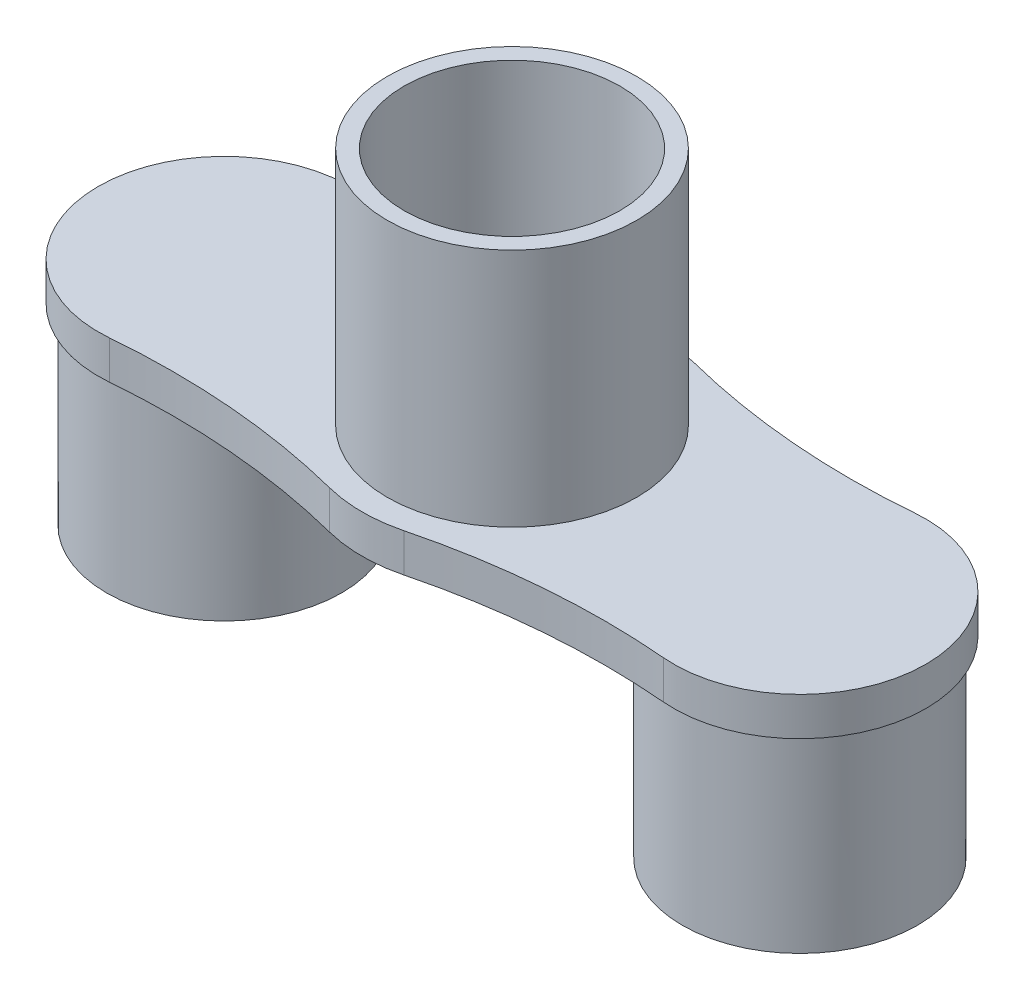
ISO-10303-21;
HEADER;
FILE_DESCRIPTION(('STEP AP214'),'2;1');
FILE_NAME('part.step','',(''),(''),'','','');
FILE_SCHEMA(('AUTOMOTIVE_DESIGN { 1 0 10303 214 1 1 1 1 }'));
ENDSEC;
DATA;
#1=APPLICATION_CONTEXT('core data for automotive mechanical design processes');
#2=APPLICATION_PROTOCOL_DEFINITION('international standard','automotive_design',2000,#1);
#3=PRODUCT_CONTEXT('',#1,'mechanical');
#4=PRODUCT('Part','Part','',(#3));
#5=PRODUCT_RELATED_PRODUCT_CATEGORY('part','',(#4));
#6=PRODUCT_DEFINITION_FORMATION('','',#4);
#7=PRODUCT_DEFINITION_CONTEXT('part definition',#1,'design');
#8=PRODUCT_DEFINITION('design','',#6,#7);
#9=PRODUCT_DEFINITION_SHAPE('','',#8);
#10=(LENGTH_UNIT() NAMED_UNIT(*) SI_UNIT(.MILLI.,.METRE.));
#11=(NAMED_UNIT(*) PLANE_ANGLE_UNIT() SI_UNIT($,.RADIAN.));
#12=(NAMED_UNIT(*) SI_UNIT($,.STERADIAN.) SOLID_ANGLE_UNIT());
#13=UNCERTAINTY_MEASURE_WITH_UNIT(LENGTH_MEASURE(1.E-05),#10,'distance_accuracy_value','');
#14=(GEOMETRIC_REPRESENTATION_CONTEXT(3) GLOBAL_UNCERTAINTY_ASSIGNED_CONTEXT((#13)) GLOBAL_UNIT_ASSIGNED_CONTEXT((#10,
#11,#12)) REPRESENTATION_CONTEXT('',''));
#15=CARTESIAN_POINT('',(0.,0.,0.));
#16=DIRECTION('',(0.,0.,1.));
#17=DIRECTION('',(1.,0.,0.));
#18=AXIS2_PLACEMENT_3D('',#15,#16,#17);
#19=CARTESIAN_POINT('',(-44.8958333333334,8.,-175.60161345872));
#20=DIRECTION('',(0.,-1.,0.));
#21=DIRECTION('',(0.,0.,-1.));
#22=AXIS2_PLACEMENT_3D('',#19,#20,#21);
#23=CYLINDRICAL_SURFACE('',#22,150.);
#24=CARTESIAN_POINT('',(-44.8958333333334,0.,-175.60161345872));
#25=DIRECTION('',(0.,-1.,0.));
#26=DIRECTION('',(0.,0.,1.));
#27=AXIS2_PLACEMENT_3D('',#24,#25,#26);
#28=CIRCLE('',#27,150.);
#29=CARTESIAN_POINT('',(-7.74066091954024,0.,-30.2761402515034));
#30=VERTEX_POINT('',#29);
#31=CARTESIAN_POINT('',(-57.7504432624114,0.,-26.1534317917242));
#32=VERTEX_POINT('',#31);
#33=EDGE_CURVE('E150',#30,#32,#28,.T.);
#34=ORIENTED_EDGE('',*,*,#33,.T.);
#35=DIRECTION('',(0.,-1.,0.));
#36=VECTOR('',#35,1.);
#37=CARTESIAN_POINT('',(-57.7504432624114,8.,-26.1534317917242));
#38=LINE('',#37,#36);
#39=CARTESIAN_POINT('',(-57.7504432624114,8.,-26.1534317917242));
#40=VERTEX_POINT('',#39);
#41=EDGE_CURVE('E178',#40,#32,#38,.T.);
#42=ORIENTED_EDGE('',*,*,#41,.F.);
#43=CARTESIAN_POINT('',(-44.8958333333334,8.,-175.60161345872));
#44=DIRECTION('',(0.,-1.,0.));
#45=DIRECTION('',(0.,0.,1.));
#46=AXIS2_PLACEMENT_3D('',#43,#44,#45);
#47=CIRCLE('',#46,150.);
#48=CARTESIAN_POINT('',(-7.74066091954024,8.,-30.2761402515034));
#49=VERTEX_POINT('',#48);
#50=EDGE_CURVE('E165',#49,#40,#47,.T.);
#51=ORIENTED_EDGE('',*,*,#50,.F.);
#52=DIRECTION('',(0.,-1.,0.));
#53=VECTOR('',#52,1.);
#54=CARTESIAN_POINT('',(-7.74066091954024,8.,-30.2761402515034));
#55=LINE('',#54,#53);
#56=EDGE_CURVE('E146',#49,#30,#55,.T.);
#57=ORIENTED_EDGE('',*,*,#56,.T.);
#58=EDGE_LOOP('',(#34,#42,#51,#57));
#59=FACE_BOUND('',#58,.T.);
#60=ADVANCED_FACE('F53',(#59),#23,.F.);
#61=CARTESIAN_POINT('',(-60.,8.,0.));
#62=DIRECTION('',(0.,-1.,0.));
#63=DIRECTION('',(0.,0.,-1.));
#64=AXIS2_PLACEMENT_3D('',#61,#62,#63);
#65=CYLINDRICAL_SURFACE('',#64,26.25);
#66=CARTESIAN_POINT('',(-60.,0.,0.));
#67=DIRECTION('',(0.,1.,0.));
#68=DIRECTION('',(0.,0.,1.));
#69=AXIS2_PLACEMENT_3D('',#66,#67,#68);
#70=CIRCLE('',#69,26.25);
#71=CARTESIAN_POINT('',(-57.7504432624114,0.,26.1534317917242));
#72=VERTEX_POINT('',#71);
#73=EDGE_CURVE('E153',#32,#72,#70,.T.);
#74=ORIENTED_EDGE('',*,*,#73,.T.);
#75=DIRECTION('',(0.,-1.,0.));
#76=VECTOR('',#75,1.);
#77=CARTESIAN_POINT('',(-57.7504432624114,8.,26.1534317917242));
#78=LINE('',#77,#76);
#79=CARTESIAN_POINT('',(-57.7504432624114,8.,26.1534317917242));
#80=VERTEX_POINT('',#79);
#81=EDGE_CURVE('E175',#80,#72,#78,.T.);
#82=ORIENTED_EDGE('',*,*,#81,.F.);
#83=CARTESIAN_POINT('',(-60.,8.,0.));
#84=DIRECTION('',(0.,1.,0.));
#85=DIRECTION('',(0.,0.,1.));
#86=AXIS2_PLACEMENT_3D('',#83,#84,#85);
#87=CIRCLE('',#86,26.25);
#88=EDGE_CURVE('E113',#40,#80,#87,.T.);
#89=ORIENTED_EDGE('',*,*,#88,.F.);
#90=ORIENTED_EDGE('',*,*,#41,.T.);
#91=EDGE_LOOP('',(#74,#82,#89,#90));
#92=FACE_BOUND('',#91,.T.);
#93=ADVANCED_FACE('F212',(#92),#65,.T.);
#94=CARTESIAN_POINT('',(-44.8958333333333,8.,175.60161345872));
#95=DIRECTION('',(0.,-1.,0.));
#96=DIRECTION('',(0.,0.,-1.));
#97=AXIS2_PLACEMENT_3D('',#94,#95,#96);
#98=CYLINDRICAL_SURFACE('',#97,150.);
#99=CARTESIAN_POINT('',(-44.8958333333333,0.,175.60161345872));
#100=DIRECTION('',(0.,-1.,0.));
#101=DIRECTION('',(0.,0.,-1.));
#102=AXIS2_PLACEMENT_3D('',#99,#100,#101);
#103=CIRCLE('',#102,150.);
#104=CARTESIAN_POINT('',(-7.74066091954027,0.,30.2761402515034));
#105=VERTEX_POINT('',#104);
#106=EDGE_CURVE('E156',#72,#105,#103,.T.);
#107=ORIENTED_EDGE('',*,*,#106,.T.);
#108=DIRECTION('',(0.,-1.,0.));
#109=VECTOR('',#108,1.);
#110=CARTESIAN_POINT('',(-7.74066091954027,8.,30.2761402515034));
#111=LINE('',#110,#109);
#112=CARTESIAN_POINT('',(-7.74066091954027,8.,30.2761402515034));
#113=VERTEX_POINT('',#112);
#114=EDGE_CURVE('E172',#113,#105,#111,.T.);
#115=ORIENTED_EDGE('',*,*,#114,.F.);
#116=CARTESIAN_POINT('',(-44.8958333333333,8.,175.60161345872));
#117=DIRECTION('',(0.,-1.,0.));
#118=DIRECTION('',(0.,0.,-1.));
#119=AXIS2_PLACEMENT_3D('',#116,#117,#118);
#120=CIRCLE('',#119,150.);
#121=EDGE_CURVE('E403',#80,#113,#120,.T.);
#122=ORIENTED_EDGE('',*,*,#121,.F.);
#123=ORIENTED_EDGE('',*,*,#81,.T.);
#124=EDGE_LOOP('',(#107,#115,#122,#123));
#125=FACE_BOUND('',#124,.T.);
#126=ADVANCED_FACE('F216',(#125),#98,.F.);
#127=CARTESIAN_POINT('',(0.,8.,0.));
#128=DIRECTION('',(0.,-1.,0.));
#129=DIRECTION('',(0.,0.,-1.));
#130=AXIS2_PLACEMENT_3D('',#127,#128,#129);
#131=CYLINDRICAL_SURFACE('',#130,31.25);
#132=CARTESIAN_POINT('',(0.,0.,0.));
#133=DIRECTION('',(0.,1.,0.));
#134=DIRECTION('',(0.,0.,1.));
#135=AXIS2_PLACEMENT_3D('',#132,#133,#134);
#136=CIRCLE('',#135,31.25);
#137=CARTESIAN_POINT('',(7.74066091954025,0.,30.2761402515034));
#138=VERTEX_POINT('',#137);
#139=EDGE_CURVE('E158',#105,#138,#136,.T.);
#140=ORIENTED_EDGE('',*,*,#139,.T.);
#141=DIRECTION('',(0.,-1.,0.));
#142=VECTOR('',#141,1.);
#143=CARTESIAN_POINT('',(7.74066091954025,8.,30.2761402515034));
#144=LINE('',#143,#142);
#145=CARTESIAN_POINT('',(7.74066091954025,8.,30.2761402515034));
#146=VERTEX_POINT('',#145);
#147=EDGE_CURVE('E169',#146,#138,#144,.T.);
#148=ORIENTED_EDGE('',*,*,#147,.F.);
#149=CARTESIAN_POINT('',(0.,8.,0.));
#150=DIRECTION('',(0.,1.,0.));
#151=DIRECTION('',(0.,0.,1.));
#152=AXIS2_PLACEMENT_3D('',#149,#150,#151);
#153=CIRCLE('',#152,31.25);
#154=EDGE_CURVE('E405',#113,#146,#153,.T.);
#155=ORIENTED_EDGE('',*,*,#154,.F.);
#156=ORIENTED_EDGE('',*,*,#114,.T.);
#157=EDGE_LOOP('',(#140,#148,#155,#156));
#158=FACE_BOUND('',#157,.T.);
#159=ADVANCED_FACE('F220',(#158),#131,.T.);
#160=CARTESIAN_POINT('',(44.8958333333334,8.,175.60161345872));
#161=DIRECTION('',(0.,-1.,0.));
#162=DIRECTION('',(0.,0.,-1.));
#163=AXIS2_PLACEMENT_3D('',#160,#161,#162);
#164=CYLINDRICAL_SURFACE('',#163,150.);
#165=CARTESIAN_POINT('',(44.8958333333334,0.,175.60161345872));
#166=DIRECTION('',(0.,-1.,0.));
#167=DIRECTION('',(0.,0.,1.));
#168=AXIS2_PLACEMENT_3D('',#165,#166,#167);
#169=CIRCLE('',#168,150.);
#170=CARTESIAN_POINT('',(57.7504432624114,0.,26.1534317917242));
#171=VERTEX_POINT('',#170);
#172=EDGE_CURVE('E160',#138,#171,#169,.T.);
#173=ORIENTED_EDGE('',*,*,#172,.T.);
#174=DIRECTION('',(0.,-1.,0.));
#175=VECTOR('',#174,1.);
#176=CARTESIAN_POINT('',(57.7504432624114,8.,26.1534317917242));
#177=LINE('',#176,#175);
#178=CARTESIAN_POINT('',(57.7504432624114,8.,26.1534317917242));
#179=VERTEX_POINT('',#178);
#180=EDGE_CURVE('E141',#179,#171,#177,.T.);
#181=ORIENTED_EDGE('',*,*,#180,.F.);
#182=CARTESIAN_POINT('',(44.8958333333334,8.,175.60161345872));
#183=DIRECTION('',(0.,-1.,0.));
#184=DIRECTION('',(0.,0.,1.));
#185=AXIS2_PLACEMENT_3D('',#182,#183,#184);
#186=CIRCLE('',#185,150.);
#187=EDGE_CURVE('E132',#146,#179,#186,.T.);
#188=ORIENTED_EDGE('',*,*,#187,.F.);
#189=ORIENTED_EDGE('',*,*,#147,.T.);
#190=EDGE_LOOP('',(#173,#181,#188,#189));
#191=FACE_BOUND('',#190,.T.);
#192=ADVANCED_FACE('F226',(#191),#164,.F.);
#193=CARTESIAN_POINT('',(60.,8.,0.));
#194=DIRECTION('',(0.,-1.,0.));
#195=DIRECTION('',(0.,0.,-1.));
#196=AXIS2_PLACEMENT_3D('',#193,#194,#195);
#197=CYLINDRICAL_SURFACE('',#196,26.25);
#198=CARTESIAN_POINT('',(60.,0.,0.));
#199=DIRECTION('',(0.,1.,0.));
#200=DIRECTION('',(0.,0.,1.));
#201=AXIS2_PLACEMENT_3D('',#198,#199,#200);
#202=CIRCLE('',#201,26.25);
#203=CARTESIAN_POINT('',(57.7504432624113,0.,-26.1534317917242));
#204=VERTEX_POINT('',#203);
#205=EDGE_CURVE('E140',#171,#204,#202,.T.);
#206=ORIENTED_EDGE('',*,*,#205,.T.);
#207=DIRECTION('',(0.,-1.,0.));
#208=VECTOR('',#207,1.);
#209=CARTESIAN_POINT('',(57.7504432624113,8.,-26.1534317917242));
#210=LINE('',#209,#208);
#211=CARTESIAN_POINT('',(57.7504432624113,8.,-26.1534317917242));
#212=VERTEX_POINT('',#211);
#213=EDGE_CURVE('E137',#212,#204,#210,.T.);
#214=ORIENTED_EDGE('',*,*,#213,.F.);
#215=CARTESIAN_POINT('',(60.,8.,0.));
#216=DIRECTION('',(0.,1.,0.));
#217=DIRECTION('',(0.,0.,1.));
#218=AXIS2_PLACEMENT_3D('',#215,#216,#217);
#219=CIRCLE('',#218,26.25);
#220=EDGE_CURVE('E126',#179,#212,#219,.T.);
#221=ORIENTED_EDGE('',*,*,#220,.F.);
#222=ORIENTED_EDGE('',*,*,#180,.T.);
#223=EDGE_LOOP('',(#206,#214,#221,#222));
#224=FACE_BOUND('',#223,.T.);
#225=ADVANCED_FACE('F138',(#224),#197,.T.);
#226=CARTESIAN_POINT('',(44.8958333333334,8.,-175.60161345872));
#227=DIRECTION('',(0.,-1.,0.));
#228=DIRECTION('',(0.,0.,-1.));
#229=AXIS2_PLACEMENT_3D('',#226,#227,#228);
#230=CYLINDRICAL_SURFACE('',#229,150.);
#231=CARTESIAN_POINT('',(44.8958333333334,0.,-175.60161345872));
#232=DIRECTION('',(0.,-1.,0.));
#233=DIRECTION('',(0.,0.,-1.));
#234=AXIS2_PLACEMENT_3D('',#231,#232,#233);
#235=CIRCLE('',#234,150.);
#236=CARTESIAN_POINT('',(7.74066091954026,0.,-30.2761402515034));
#237=VERTEX_POINT('',#236);
#238=EDGE_CURVE('E98',#204,#237,#235,.T.);
#239=ORIENTED_EDGE('',*,*,#238,.T.);
#240=DIRECTION('',(0.,-1.,0.));
#241=VECTOR('',#240,1.);
#242=CARTESIAN_POINT('',(7.74066091954026,8.,-30.2761402515034));
#243=LINE('',#242,#241);
#244=CARTESIAN_POINT('',(7.74066091954026,8.,-30.2761402515034));
#245=VERTEX_POINT('',#244);
#246=EDGE_CURVE('E142',#245,#237,#243,.T.);
#247=ORIENTED_EDGE('',*,*,#246,.F.);
#248=CARTESIAN_POINT('',(44.8958333333334,8.,-175.60161345872));
#249=DIRECTION('',(0.,-1.,0.));
#250=DIRECTION('',(0.,0.,-1.));
#251=AXIS2_PLACEMENT_3D('',#248,#249,#250);
#252=CIRCLE('',#251,150.);
#253=EDGE_CURVE('E130',#212,#245,#252,.T.);
#254=ORIENTED_EDGE('',*,*,#253,.F.);
#255=ORIENTED_EDGE('',*,*,#213,.T.);
#256=EDGE_LOOP('',(#239,#247,#254,#255));
#257=FACE_BOUND('',#256,.T.);
#258=ADVANCED_FACE('F144',(#257),#230,.F.);
#259=CARTESIAN_POINT('',(0.,8.,0.));
#260=DIRECTION('',(0.,-1.,0.));
#261=DIRECTION('',(0.,0.,-1.));
#262=AXIS2_PLACEMENT_3D('',#259,#260,#261);
#263=CYLINDRICAL_SURFACE('',#262,31.25);
#264=CARTESIAN_POINT('',(0.,0.,0.));
#265=DIRECTION('',(0.,1.,0.));
#266=DIRECTION('',(0.,0.,1.));
#267=AXIS2_PLACEMENT_3D('',#264,#265,#266);
#268=CIRCLE('',#267,31.25);
#269=EDGE_CURVE('E104',#237,#30,#268,.T.);
#270=ORIENTED_EDGE('',*,*,#269,.T.);
#271=ORIENTED_EDGE('',*,*,#56,.F.);
#272=CARTESIAN_POINT('',(0.,8.,0.));
#273=DIRECTION('',(0.,1.,0.));
#274=DIRECTION('',(0.,0.,1.));
#275=AXIS2_PLACEMENT_3D('',#272,#273,#274);
#276=CIRCLE('',#275,31.25);
#277=EDGE_CURVE('E69',#245,#49,#276,.T.);
#278=ORIENTED_EDGE('',*,*,#277,.F.);
#279=ORIENTED_EDGE('',*,*,#246,.T.);
#280=EDGE_LOOP('',(#270,#271,#278,#279));
#281=FACE_BOUND('',#280,.T.);
#282=ADVANCED_FACE('F200',(#281),#263,.T.);
#283=CARTESIAN_POINT('',(-22.4479166666667,8.,-87.8008067293598));
#284=DIRECTION('',(0.,1.,0.));
#285=DIRECTION('',(0.,0.,1.));
#286=AXIS2_PLACEMENT_3D('',#283,#284,#285);
#287=PLANE('',#286);
#288=CARTESIAN_POINT('',(0.,8.,0.));
#289=DIRECTION('',(0.,1.,0.));
#290=DIRECTION('',(1.,0.,0.));
#291=AXIS2_PLACEMENT_3D('',#288,#289,#290);
#292=CIRCLE('',#291,26.);
#293=CARTESIAN_POINT('',(26.,8.,0.));
#294=VERTEX_POINT('',#293);
#295=EDGE_CURVE('E396',#294,#294,#292,.T.);
#296=ORIENTED_EDGE('',*,*,#295,.F.);
#297=EDGE_LOOP('',(#296));
#298=FACE_BOUND('',#297,.T.);
#299=ORIENTED_EDGE('',*,*,#50,.T.);
#300=ORIENTED_EDGE('',*,*,#88,.T.);
#301=ORIENTED_EDGE('',*,*,#121,.T.);
#302=ORIENTED_EDGE('',*,*,#154,.T.);
#303=ORIENTED_EDGE('',*,*,#187,.T.);
#304=ORIENTED_EDGE('',*,*,#220,.T.);
#305=ORIENTED_EDGE('',*,*,#253,.T.);
#306=ORIENTED_EDGE('',*,*,#277,.T.);
#307=EDGE_LOOP('',(#299,#300,#301,#302,#303,#304,#305,#306));
#308=FACE_BOUND('',#307,.T.);
#309=ADVANCED_FACE('F128',(#298,#308),#287,.T.);
#310=CARTESIAN_POINT('',(-22.4479166666667,0.,-87.8008067293598));
#311=DIRECTION('',(0.,1.,0.));
#312=DIRECTION('',(0.,0.,1.));
#313=AXIS2_PLACEMENT_3D('',#310,#311,#312);
#314=PLANE('',#313);
#315=CARTESIAN_POINT('',(60.,0.,0.));
#316=DIRECTION('',(0.,1.,0.));
#317=DIRECTION('',(0.,0.,1.));
#318=AXIS2_PLACEMENT_3D('',#315,#316,#317);
#319=CIRCLE('',#318,24.5);
#320=CARTESIAN_POINT('',(60.,0.,24.5));
#321=VERTEX_POINT('',#320);
#322=EDGE_CURVE('E12',#321,#321,#319,.F.);
#323=ORIENTED_EDGE('',*,*,#322,.F.);
#324=EDGE_LOOP('',(#323));
#325=FACE_BOUND('',#324,.T.);
#326=CARTESIAN_POINT('',(-60.,0.,0.));
#327=DIRECTION('',(0.,1.,0.));
#328=DIRECTION('',(0.,0.,1.));
#329=AXIS2_PLACEMENT_3D('',#326,#327,#328);
#330=CIRCLE('',#329,24.5);
#331=CARTESIAN_POINT('',(-60.,0.,24.5));
#332=VERTEX_POINT('',#331);
#333=EDGE_CURVE('E61',#332,#332,#330,.F.);
#334=ORIENTED_EDGE('',*,*,#333,.F.);
#335=EDGE_LOOP('',(#334));
#336=FACE_BOUND('',#335,.T.);
#337=ORIENTED_EDGE('',*,*,#33,.F.);
#338=ORIENTED_EDGE('',*,*,#269,.F.);
#339=ORIENTED_EDGE('',*,*,#238,.F.);
#340=ORIENTED_EDGE('',*,*,#205,.F.);
#341=ORIENTED_EDGE('',*,*,#172,.F.);
#342=ORIENTED_EDGE('',*,*,#139,.F.);
#343=ORIENTED_EDGE('',*,*,#106,.F.);
#344=ORIENTED_EDGE('',*,*,#73,.F.);
#345=EDGE_LOOP('',(#337,#338,#339,#340,#341,#342,#343,#344));
#346=FACE_BOUND('',#345,.T.);
#347=ADVANCED_FACE('F187',(#325,#336,#346),#314,.F.);
#348=CARTESIAN_POINT('',(0.,58.,0.));
#349=DIRECTION('',(0.,1.,0.));
#350=DIRECTION('',(0.,0.,1.));
#351=AXIS2_PLACEMENT_3D('',#348,#349,#350);
#352=PLANE('',#351);
#353=CARTESIAN_POINT('',(0.,58.,0.));
#354=DIRECTION('',(0.,1.,0.));
#355=DIRECTION('',(1.,0.,0.));
#356=AXIS2_PLACEMENT_3D('',#353,#354,#355);
#357=CIRCLE('',#356,26.);
#358=CARTESIAN_POINT('',(26.,58.,0.));
#359=VERTEX_POINT('',#358);
#360=EDGE_CURVE('E154',#359,#359,#357,.T.);
#361=ORIENTED_EDGE('',*,*,#360,.T.);
#362=EDGE_LOOP('',(#361));
#363=FACE_BOUND('',#362,.T.);
#364=CARTESIAN_POINT('',(0.,58.,0.));
#365=DIRECTION('',(0.,1.,0.));
#366=DIRECTION('',(0.,0.,1.));
#367=AXIS2_PLACEMENT_3D('',#364,#365,#366);
#368=CIRCLE('',#367,22.5);
#369=CARTESIAN_POINT('',(0.,58.,22.5));
#370=VERTEX_POINT('',#369);
#371=EDGE_CURVE('E393',#370,#370,#368,.T.);
#372=ORIENTED_EDGE('',*,*,#371,.F.);
#373=EDGE_LOOP('',(#372));
#374=FACE_BOUND('',#373,.T.);
#375=ADVANCED_FACE('F190',(#363,#374),#352,.T.);
#376=CARTESIAN_POINT('',(0.,58.,0.));
#377=DIRECTION('',(0.,-1.,0.));
#378=DIRECTION('',(0.,0.,-1.));
#379=AXIS2_PLACEMENT_3D('',#376,#377,#378);
#380=CYLINDRICAL_SURFACE('',#379,26.);
#381=ORIENTED_EDGE('',*,*,#360,.F.);
#382=EDGE_LOOP('',(#381));
#383=FACE_BOUND('',#382,.T.);
#384=ORIENTED_EDGE('',*,*,#295,.T.);
#385=EDGE_LOOP('',(#384));
#386=FACE_BOUND('',#385,.T.);
#387=ADVANCED_FACE('F260',(#383,#386),#380,.T.);
#388=CARTESIAN_POINT('',(0.,58.,0.));
#389=DIRECTION('',(0.,-1.,0.));
#390=DIRECTION('',(0.,0.,-1.));
#391=AXIS2_PLACEMENT_3D('',#388,#389,#390);
#392=CYLINDRICAL_SURFACE('',#391,22.5);
#393=ORIENTED_EDGE('',*,*,#371,.T.);
#394=EDGE_LOOP('',(#393));
#395=FACE_BOUND('',#394,.T.);
#396=CARTESIAN_POINT('',(0.,8.,0.));
#397=DIRECTION('',(0.,1.,0.));
#398=DIRECTION('',(0.,0.,1.));
#399=AXIS2_PLACEMENT_3D('',#396,#397,#398);
#400=CIRCLE('',#399,22.5);
#401=CARTESIAN_POINT('',(0.,8.,22.5));
#402=VERTEX_POINT('',#401);
#403=EDGE_CURVE('E180',#402,#402,#400,.F.);
#404=ORIENTED_EDGE('',*,*,#403,.T.);
#405=EDGE_LOOP('',(#404));
#406=FACE_BOUND('',#405,.T.);
#407=ADVANCED_FACE('F271',(#395,#406),#392,.F.);
#408=ORIENTED_EDGE('',*,*,#403,.F.);
#409=EDGE_LOOP('',(#408));
#410=FACE_BOUND('',#409,.T.);
#411=ADVANCED_FACE('F209',(#410),#287,.T.);
#412=CARTESIAN_POINT('',(-60.,-40.,0.));
#413=DIRECTION('',(0.,-1.,0.));
#414=DIRECTION('',(0.,0.,-1.));
#415=AXIS2_PLACEMENT_3D('',#412,#413,#414);
#416=PLANE('',#415);
#417=CARTESIAN_POINT('',(-60.,-40.,0.));
#418=DIRECTION('',(0.,-1.,0.));
#419=DIRECTION('',(1.,0.,0.));
#420=AXIS2_PLACEMENT_3D('',#417,#418,#419);
#421=CIRCLE('',#420,24.5);
#422=CARTESIAN_POINT('',(-35.5,-40.,0.));
#423=VERTEX_POINT('',#422);
#424=EDGE_CURVE('E388',#423,#423,#421,.T.);
#425=ORIENTED_EDGE('',*,*,#424,.T.);
#426=EDGE_LOOP('',(#425));
#427=FACE_BOUND('',#426,.T.);
#428=CARTESIAN_POINT('',(-60.,-40.,0.));
#429=DIRECTION('',(0.,-1.,0.));
#430=DIRECTION('',(0.,0.,-1.));
#431=AXIS2_PLACEMENT_3D('',#428,#429,#430);
#432=CIRCLE('',#431,22.5);
#433=CARTESIAN_POINT('',(-60.,-40.,-22.5));
#434=VERTEX_POINT('',#433);
#435=EDGE_CURVE('E385',#434,#434,#432,.T.);
#436=ORIENTED_EDGE('',*,*,#435,.F.);
#437=EDGE_LOOP('',(#436));
#438=FACE_BOUND('',#437,.T.);
#439=ADVANCED_FACE('F290',(#427,#438),#416,.T.);
#440=CARTESIAN_POINT('',(-60.,-40.,0.));
#441=DIRECTION('',(0.,1.,0.));
#442=DIRECTION('',(0.,0.,1.));
#443=AXIS2_PLACEMENT_3D('',#440,#441,#442);
#444=CYLINDRICAL_SURFACE('',#443,24.5);
#445=ORIENTED_EDGE('',*,*,#424,.F.);
#446=EDGE_LOOP('',(#445));
#447=FACE_BOUND('',#446,.T.);
#448=ORIENTED_EDGE('',*,*,#333,.T.);
#449=EDGE_LOOP('',(#448));
#450=FACE_BOUND('',#449,.T.);
#451=ADVANCED_FACE('F185',(#447,#450),#444,.T.);
#452=CARTESIAN_POINT('',(-60.,-40.,0.));
#453=DIRECTION('',(0.,1.,0.));
#454=DIRECTION('',(0.,0.,1.));
#455=AXIS2_PLACEMENT_3D('',#452,#453,#454);
#456=CYLINDRICAL_SURFACE('',#455,22.5);
#457=ORIENTED_EDGE('',*,*,#435,.T.);
#458=EDGE_LOOP('',(#457));
#459=FACE_BOUND('',#458,.T.);
#460=CARTESIAN_POINT('',(-60.,0.,0.));
#461=DIRECTION('',(0.,-1.,0.));
#462=DIRECTION('',(0.,0.,-1.));
#463=AXIS2_PLACEMENT_3D('',#460,#461,#462);
#464=CIRCLE('',#463,22.5);
#465=CARTESIAN_POINT('',(-60.,0.,-22.5));
#466=VERTEX_POINT('',#465);
#467=EDGE_CURVE('E384',#466,#466,#464,.T.);
#468=ORIENTED_EDGE('',*,*,#467,.F.);
#469=EDGE_LOOP('',(#468));
#470=FACE_BOUND('',#469,.T.);
#471=ADVANCED_FACE('F314',(#459,#470),#456,.F.);
#472=ORIENTED_EDGE('',*,*,#467,.T.);
#473=EDGE_LOOP('',(#472));
#474=FACE_BOUND('',#473,.T.);
#475=ADVANCED_FACE('F194',(#474),#314,.F.);
#476=CARTESIAN_POINT('',(60.,-40.,0.));
#477=DIRECTION('',(0.,-1.,0.));
#478=DIRECTION('',(0.,0.,-1.));
#479=AXIS2_PLACEMENT_3D('',#476,#477,#478);
#480=PLANE('',#479);
#481=CARTESIAN_POINT('',(60.,-40.,0.));
#482=DIRECTION('',(0.,-1.,0.));
#483=DIRECTION('',(1.,0.,0.));
#484=AXIS2_PLACEMENT_3D('',#481,#482,#483);
#485=CIRCLE('',#484,24.5);
#486=CARTESIAN_POINT('',(84.5,-40.,0.));
#487=VERTEX_POINT('',#486);
#488=EDGE_CURVE('E379',#487,#487,#485,.T.);
#489=ORIENTED_EDGE('',*,*,#488,.T.);
#490=EDGE_LOOP('',(#489));
#491=FACE_BOUND('',#490,.T.);
#492=CARTESIAN_POINT('',(60.,-40.,0.));
#493=DIRECTION('',(0.,-1.,0.));
#494=DIRECTION('',(0.,0.,-1.));
#495=AXIS2_PLACEMENT_3D('',#492,#493,#494);
#496=CIRCLE('',#495,22.5);
#497=CARTESIAN_POINT('',(60.,-40.,-22.5));
#498=VERTEX_POINT('',#497);
#499=EDGE_CURVE('E376',#498,#498,#496,.T.);
#500=ORIENTED_EDGE('',*,*,#499,.F.);
#501=EDGE_LOOP('',(#500));
#502=FACE_BOUND('',#501,.T.);
#503=ADVANCED_FACE('F333',(#491,#502),#480,.T.);
#504=CARTESIAN_POINT('',(60.,-40.,0.));
#505=DIRECTION('',(0.,1.,0.));
#506=DIRECTION('',(0.,0.,1.));
#507=AXIS2_PLACEMENT_3D('',#504,#505,#506);
#508=CYLINDRICAL_SURFACE('',#507,24.5);
#509=ORIENTED_EDGE('',*,*,#488,.F.);
#510=EDGE_LOOP('',(#509));
#511=FACE_BOUND('',#510,.T.);
#512=ORIENTED_EDGE('',*,*,#322,.T.);
#513=EDGE_LOOP('',(#512));
#514=FACE_BOUND('',#513,.T.);
#515=ADVANCED_FACE('F341',(#511,#514),#508,.T.);
#516=CARTESIAN_POINT('',(60.,-40.,0.));
#517=DIRECTION('',(0.,1.,0.));
#518=DIRECTION('',(0.,0.,1.));
#519=AXIS2_PLACEMENT_3D('',#516,#517,#518);
#520=CYLINDRICAL_SURFACE('',#519,22.5);
#521=ORIENTED_EDGE('',*,*,#499,.T.);
#522=EDGE_LOOP('',(#521));
#523=FACE_BOUND('',#522,.T.);
#524=CARTESIAN_POINT('',(60.,0.,0.));
#525=DIRECTION('',(0.,-1.,0.));
#526=DIRECTION('',(0.,0.,-1.));
#527=AXIS2_PLACEMENT_3D('',#524,#525,#526);
#528=CIRCLE('',#527,22.5);
#529=CARTESIAN_POINT('',(60.,0.,-22.5));
#530=VERTEX_POINT('',#529);
#531=EDGE_CURVE('E374',#530,#530,#528,.T.);
#532=ORIENTED_EDGE('',*,*,#531,.F.);
#533=EDGE_LOOP('',(#532));
#534=FACE_BOUND('',#533,.T.);
#535=ADVANCED_FACE('F351',(#523,#534),#520,.F.);
#536=ORIENTED_EDGE('',*,*,#531,.T.);
#537=EDGE_LOOP('',(#536));
#538=FACE_BOUND('',#537,.T.);
#539=ADVANCED_FACE('F193',(#538),#314,.F.);
#540=CLOSED_SHELL('',(#60,#93,#126,#159,#192,#225,#258,#282,#309,#347,#375,#387,#407,#411,#439,
#451,#471,#475,#503,#515,#535,#539));
#541=MANIFOLD_SOLID_BREP('B2',#540);
#542=ADVANCED_BREP_SHAPE_REPRESENTATION('',(#18,#541),#14);
#543=SHAPE_DEFINITION_REPRESENTATION(#9,#542);
ENDSEC;
END-ISO-10303-21;
